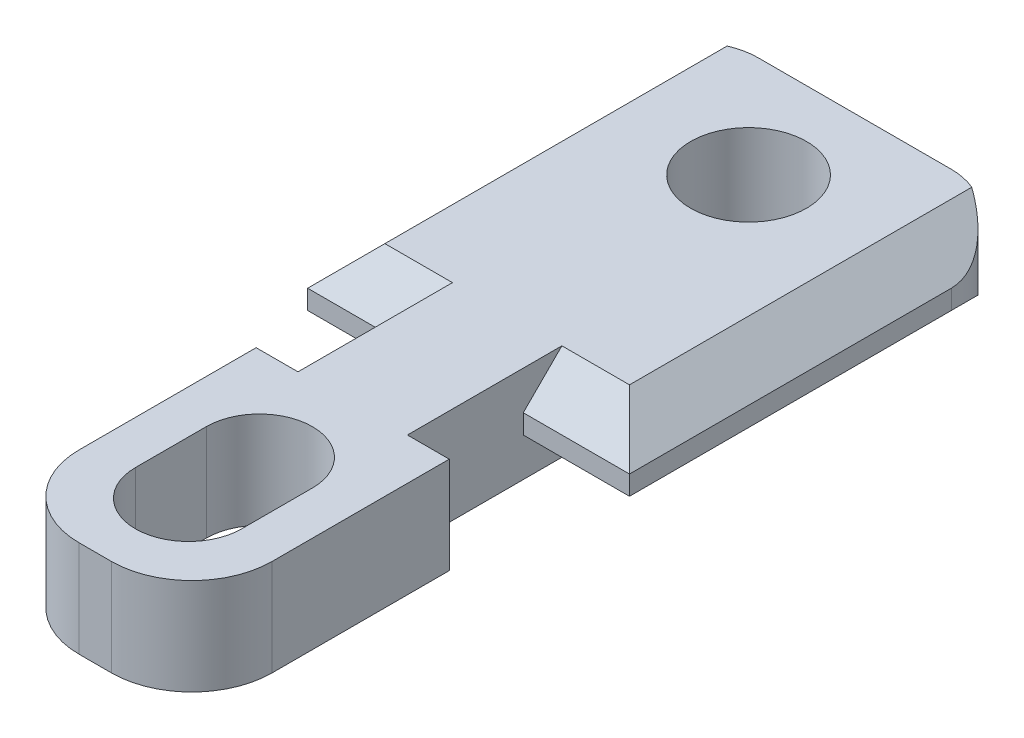
ISO-10303-21;
HEADER;
FILE_DESCRIPTION(('STEP AP214'),'2;1');
FILE_NAME('part.step','',(''),(''),'','','');
FILE_SCHEMA(('AUTOMOTIVE_DESIGN { 1 0 10303 214 1 1 1 1 }'));
ENDSEC;
DATA;
#1=APPLICATION_CONTEXT('core data for automotive mechanical design processes');
#2=APPLICATION_PROTOCOL_DEFINITION('international standard','automotive_design',2000,#1);
#3=PRODUCT_CONTEXT('',#1,'mechanical');
#4=PRODUCT('Part','Part','',(#3));
#5=PRODUCT_RELATED_PRODUCT_CATEGORY('part','',(#4));
#6=PRODUCT_DEFINITION_FORMATION('','',#4);
#7=PRODUCT_DEFINITION_CONTEXT('part definition',#1,'design');
#8=PRODUCT_DEFINITION('design','',#6,#7);
#9=PRODUCT_DEFINITION_SHAPE('','',#8);
#10=(LENGTH_UNIT() NAMED_UNIT(*) SI_UNIT(.MILLI.,.METRE.));
#11=(NAMED_UNIT(*) PLANE_ANGLE_UNIT() SI_UNIT($,.RADIAN.));
#12=(NAMED_UNIT(*) SI_UNIT($,.STERADIAN.) SOLID_ANGLE_UNIT());
#13=UNCERTAINTY_MEASURE_WITH_UNIT(LENGTH_MEASURE(1.E-05),#10,'distance_accuracy_value','');
#14=(GEOMETRIC_REPRESENTATION_CONTEXT(3) GLOBAL_UNCERTAINTY_ASSIGNED_CONTEXT((#13)) GLOBAL_UNIT_ASSIGNED_CONTEXT((#10,
#11,#12)) REPRESENTATION_CONTEXT('',''));
#15=CARTESIAN_POINT('',(0.,0.,0.));
#16=DIRECTION('',(0.,0.,1.));
#17=DIRECTION('',(1.,0.,0.));
#18=AXIS2_PLACEMENT_3D('',#15,#16,#17);
#19=CARTESIAN_POINT('',(-3.,1.5,-4.));
#20=DIRECTION('',(0.,0.,1.));
#21=DIRECTION('',(1.,0.,0.));
#22=AXIS2_PLACEMENT_3D('',#19,#20,#21);
#23=PLANE('',#22);
#24=DIRECTION('',(0.,-1.,0.));
#25=VECTOR('',#24,1.);
#26=CARTESIAN_POINT('',(1.7,1.5,-4.));
#27=LINE('',#26,#25);
#28=CARTESIAN_POINT('',(1.7,1.5,-4.));
#29=VERTEX_POINT('',#28);
#30=CARTESIAN_POINT('',(1.7,-1.5,-4.));
#31=VERTEX_POINT('',#30);
#32=EDGE_CURVE('E291',#29,#31,#27,.T.);
#33=ORIENTED_EDGE('',*,*,#32,.F.);
#34=DIRECTION('',(-1.,0.,0.));
#35=VECTOR('',#34,1.);
#36=CARTESIAN_POINT('',(-3.,1.5,-4.));
#37=LINE('',#36,#35);
#38=CARTESIAN_POINT('',(3.,1.5,-4.));
#39=VERTEX_POINT('',#38);
#40=EDGE_CURVE('E307',#39,#29,#37,.T.);
#41=ORIENTED_EDGE('',*,*,#40,.F.);
#42=DIRECTION('',(0.,-1.,0.));
#43=VECTOR('',#42,1.);
#44=CARTESIAN_POINT('',(3.,1.5,-4.));
#45=LINE('',#44,#43);
#46=CARTESIAN_POINT('',(3.,-1.5,-4.));
#47=VERTEX_POINT('',#46);
#48=EDGE_CURVE('E323',#39,#47,#45,.T.);
#49=ORIENTED_EDGE('',*,*,#48,.T.);
#50=DIRECTION('',(-1.,0.,0.));
#51=VECTOR('',#50,1.);
#52=CARTESIAN_POINT('',(-3.,-1.5,-4.));
#53=LINE('',#52,#51);
#54=EDGE_CURVE('E301',#47,#31,#53,.T.);
#55=ORIENTED_EDGE('',*,*,#54,.T.);
#56=EDGE_LOOP('',(#33,#41,#49,#55));
#57=FACE_BOUND('',#56,.T.);
#58=ADVANCED_FACE('F39',(#57),#23,.F.);
#59=CARTESIAN_POINT('',(-3.,1.5,-4.));
#60=DIRECTION('',(1.,0.,0.));
#61=DIRECTION('',(0.,0.,-1.));
#62=AXIS2_PLACEMENT_3D('',#59,#60,#61);
#63=PLANE('',#62);
#64=DIRECTION('',(0.,0.,1.));
#65=VECTOR('',#64,1.);
#66=CARTESIAN_POINT('',(-3.,-1.5,-4.));
#67=LINE('',#66,#65);
#68=CARTESIAN_POINT('',(-3.,-1.5,-4.));
#69=VERTEX_POINT('',#68);
#70=CARTESIAN_POINT('',(-3.,-1.5,1.5));
#71=VERTEX_POINT('',#70);
#72=EDGE_CURVE('E296',#69,#71,#67,.T.);
#73=ORIENTED_EDGE('',*,*,#72,.T.);
#74=DIRECTION('',(0.,-1.,0.));
#75=VECTOR('',#74,1.);
#76=CARTESIAN_POINT('',(-3.,1.5,1.5));
#77=LINE('',#76,#75);
#78=CARTESIAN_POINT('',(-3.,1.5,1.5));
#79=VERTEX_POINT('',#78);
#80=EDGE_CURVE('E352',#71,#79,#77,.F.);
#81=ORIENTED_EDGE('',*,*,#80,.T.);
#82=DIRECTION('',(0.,0.,1.));
#83=VECTOR('',#82,1.);
#84=CARTESIAN_POINT('',(-3.,1.5,-4.));
#85=LINE('',#84,#83);
#86=CARTESIAN_POINT('',(-3.,1.5,-4.));
#87=VERTEX_POINT('',#86);
#88=EDGE_CURVE('E297',#87,#79,#85,.T.);
#89=ORIENTED_EDGE('',*,*,#88,.F.);
#90=DIRECTION('',(0.,-1.,0.));
#91=VECTOR('',#90,1.);
#92=CARTESIAN_POINT('',(-3.,1.5,-4.));
#93=LINE('',#92,#91);
#94=EDGE_CURVE('E310',#87,#69,#93,.T.);
#95=ORIENTED_EDGE('',*,*,#94,.T.);
#96=EDGE_LOOP('',(#73,#81,#89,#95));
#97=FACE_BOUND('',#96,.T.);
#98=ADVANCED_FACE('F495',(#97),#63,.F.);
#99=CARTESIAN_POINT('',(-3.,1.5,4.));
#100=DIRECTION('',(0.,0.,-1.));
#101=DIRECTION('',(-1.,0.,0.));
#102=AXIS2_PLACEMENT_3D('',#99,#100,#101);
#103=PLANE('',#102);
#104=DIRECTION('',(1.,0.,0.));
#105=VECTOR('',#104,1.);
#106=CARTESIAN_POINT('',(-3.,-1.5,4.));
#107=LINE('',#106,#105);
#108=CARTESIAN_POINT('',(-0.5,-1.5,4.));
#109=VERTEX_POINT('',#108);
#110=CARTESIAN_POINT('',(0.5,-1.5,4.));
#111=VERTEX_POINT('',#110);
#112=EDGE_CURVE('E313',#109,#111,#107,.T.);
#113=ORIENTED_EDGE('',*,*,#112,.T.);
#114=DIRECTION('',(0.,-1.,0.));
#115=VECTOR('',#114,1.);
#116=CARTESIAN_POINT('',(0.5,1.5,4.));
#117=LINE('',#116,#115);
#118=CARTESIAN_POINT('',(0.5,1.5,4.));
#119=VERTEX_POINT('',#118);
#120=EDGE_CURVE('E341',#111,#119,#117,.F.);
#121=ORIENTED_EDGE('',*,*,#120,.T.);
#122=DIRECTION('',(1.,0.,0.));
#123=VECTOR('',#122,1.);
#124=CARTESIAN_POINT('',(-3.,1.5,4.));
#125=LINE('',#124,#123);
#126=CARTESIAN_POINT('',(-0.5,1.5,4.));
#127=VERTEX_POINT('',#126);
#128=EDGE_CURVE('E300',#127,#119,#125,.T.);
#129=ORIENTED_EDGE('',*,*,#128,.F.);
#130=DIRECTION('',(0.,-1.,0.));
#131=VECTOR('',#130,1.);
#132=CARTESIAN_POINT('',(-0.5,1.5,4.));
#133=LINE('',#132,#131);
#134=EDGE_CURVE('E338',#127,#109,#133,.T.);
#135=ORIENTED_EDGE('',*,*,#134,.T.);
#136=EDGE_LOOP('',(#113,#121,#129,#135));
#137=FACE_BOUND('',#136,.T.);
#138=ADVANCED_FACE('F504',(#137),#103,.F.);
#139=CARTESIAN_POINT('',(3.,1.5,-4.));
#140=DIRECTION('',(-1.,0.,0.));
#141=DIRECTION('',(0.,0.,1.));
#142=AXIS2_PLACEMENT_3D('',#139,#140,#141);
#143=PLANE('',#142);
#144=DIRECTION('',(0.,0.,-1.));
#145=VECTOR('',#144,1.);
#146=CARTESIAN_POINT('',(3.,1.5,-4.));
#147=LINE('',#146,#145);
#148=CARTESIAN_POINT('',(3.,1.5,1.5));
#149=VERTEX_POINT('',#148);
#150=EDGE_CURVE('E304',#149,#39,#147,.T.);
#151=ORIENTED_EDGE('',*,*,#150,.F.);
#152=DIRECTION('',(0.,-1.,0.));
#153=VECTOR('',#152,1.);
#154=CARTESIAN_POINT('',(3.,1.5,1.5));
#155=LINE('',#154,#153);
#156=CARTESIAN_POINT('',(3.,-1.5,1.5));
#157=VERTEX_POINT('',#156);
#158=EDGE_CURVE('E326',#149,#157,#155,.T.);
#159=ORIENTED_EDGE('',*,*,#158,.T.);
#160=DIRECTION('',(0.,0.,-1.));
#161=VECTOR('',#160,1.);
#162=CARTESIAN_POINT('',(3.,-1.5,-4.));
#163=LINE('',#162,#161);
#164=EDGE_CURVE('E316',#157,#47,#163,.T.);
#165=ORIENTED_EDGE('',*,*,#164,.T.);
#166=ORIENTED_EDGE('',*,*,#48,.F.);
#167=EDGE_LOOP('',(#151,#159,#165,#166));
#168=FACE_BOUND('',#167,.T.);
#169=ADVANCED_FACE('F512',(#168),#143,.F.);
#170=CARTESIAN_POINT('',(-1.7,1.5,-4.));
#171=VERTEX_POINT('',#170);
#172=EDGE_CURVE('E306',#171,#87,#37,.T.);
#173=ORIENTED_EDGE('',*,*,#172,.F.);
#174=DIRECTION('',(0.,-1.,0.));
#175=VECTOR('',#174,1.);
#176=CARTESIAN_POINT('',(-1.7,1.5,-4.));
#177=LINE('',#176,#175);
#178=CARTESIAN_POINT('',(-1.7,-1.5,-4.));
#179=VERTEX_POINT('',#178);
#180=EDGE_CURVE('E293',#171,#179,#177,.T.);
#181=ORIENTED_EDGE('',*,*,#180,.T.);
#182=EDGE_CURVE('E318',#179,#69,#53,.T.);
#183=ORIENTED_EDGE('',*,*,#182,.T.);
#184=ORIENTED_EDGE('',*,*,#94,.F.);
#185=EDGE_LOOP('',(#173,#181,#183,#184));
#186=FACE_BOUND('',#185,.T.);
#187=ADVANCED_FACE('F489',(#186),#23,.F.);
#188=CARTESIAN_POINT('',(0.,1.5,0.));
#189=DIRECTION('',(0.,1.,0.));
#190=DIRECTION('',(0.,0.,1.));
#191=AXIS2_PLACEMENT_3D('',#188,#189,#190);
#192=PLANE('',#191);
#193=CARTESIAN_POINT('',(0.,1.5,1.1));
#194=DIRECTION('',(0.,1.,0.));
#195=DIRECTION('',(0.,0.,1.));
#196=AXIS2_PLACEMENT_3D('',#193,#194,#195);
#197=CIRCLE('',#196,1.65);
#198=CARTESIAN_POINT('',(-1.65,1.5,1.1));
#199=VERTEX_POINT('',#198);
#200=CARTESIAN_POINT('',(1.65,1.5,1.1));
#201=VERTEX_POINT('',#200);
#202=EDGE_CURVE('E236',#199,#201,#197,.T.);
#203=ORIENTED_EDGE('',*,*,#202,.F.);
#204=DIRECTION('',(0.,0.,1.));
#205=VECTOR('',#204,1.);
#206=CARTESIAN_POINT('',(-1.65,1.5,1.1));
#207=LINE('',#206,#205);
#208=CARTESIAN_POINT('',(-1.65,1.5,-1.1));
#209=VERTEX_POINT('',#208);
#210=EDGE_CURVE('E241',#209,#199,#207,.T.);
#211=ORIENTED_EDGE('',*,*,#210,.F.);
#212=CARTESIAN_POINT('',(0.,1.5,-1.1));
#213=DIRECTION('',(0.,1.,0.));
#214=DIRECTION('',(0.,0.,1.));
#215=AXIS2_PLACEMENT_3D('',#212,#213,#214);
#216=CIRCLE('',#215,1.65);
#217=CARTESIAN_POINT('',(1.65,1.5,-1.1));
#218=VERTEX_POINT('',#217);
#219=EDGE_CURVE('E220',#218,#209,#216,.T.);
#220=ORIENTED_EDGE('',*,*,#219,.F.);
#221=DIRECTION('',(0.,0.,-1.));
#222=VECTOR('',#221,1.);
#223=CARTESIAN_POINT('',(1.65,1.5,1.1));
#224=LINE('',#223,#222);
#225=EDGE_CURVE('E232',#201,#218,#224,.T.);
#226=ORIENTED_EDGE('',*,*,#225,.F.);
#227=EDGE_LOOP('',(#203,#211,#220,#226));
#228=FACE_BOUND('',#227,.T.);
#229=CARTESIAN_POINT('',(0.,1.5,-16.3));
#230=DIRECTION('',(0.,1.,0.));
#231=DIRECTION('',(0.,0.,1.));
#232=AXIS2_PLACEMENT_3D('',#229,#230,#231);
#233=CIRCLE('',#232,1.8);
#234=CARTESIAN_POINT('',(0.,1.5,-14.5));
#235=VERTEX_POINT('',#234);
#236=EDGE_CURVE('E260',#235,#235,#233,.T.);
#237=ORIENTED_EDGE('',*,*,#236,.F.);
#238=EDGE_LOOP('',(#237));
#239=FACE_BOUND('',#238,.T.);
#240=DIRECTION('',(1.,0.,0.));
#241=VECTOR('',#240,1.);
#242=CARTESIAN_POINT('',(-1.7,1.5,-8.79999999999999));
#243=LINE('',#242,#241);
#244=CARTESIAN_POINT('',(-3.80000000000001,1.5,-8.79999999999999));
#245=VERTEX_POINT('',#244);
#246=CARTESIAN_POINT('',(-1.7,1.5,-8.79999999999999));
#247=VERTEX_POINT('',#246);
#248=EDGE_CURVE('E393',#245,#247,#243,.T.);
#249=ORIENTED_EDGE('',*,*,#248,.T.);
#250=DIRECTION('',(0.,0.,1.));
#251=VECTOR('',#250,1.);
#252=CARTESIAN_POINT('',(-1.7,1.5,-4.));
#253=LINE('',#252,#251);
#254=EDGE_CURVE('E278',#247,#171,#253,.T.);
#255=ORIENTED_EDGE('',*,*,#254,.T.);
#256=ORIENTED_EDGE('',*,*,#172,.T.);
#257=ORIENTED_EDGE('',*,*,#88,.T.);
#258=CARTESIAN_POINT('',(-0.5,1.5,1.5));
#259=DIRECTION('',(0.,1.,0.));
#260=DIRECTION('',(0.,0.,1.));
#261=AXIS2_PLACEMENT_3D('',#258,#259,#260);
#262=CIRCLE('',#261,2.5);
#263=EDGE_CURVE('E348',#79,#127,#262,.T.);
#264=ORIENTED_EDGE('',*,*,#263,.T.);
#265=ORIENTED_EDGE('',*,*,#128,.T.);
#266=CARTESIAN_POINT('',(0.5,1.5,1.5));
#267=DIRECTION('',(0.,1.,0.));
#268=DIRECTION('',(0.,0.,1.));
#269=AXIS2_PLACEMENT_3D('',#266,#267,#268);
#270=CIRCLE('',#269,2.5);
#271=EDGE_CURVE('E350',#119,#149,#270,.T.);
#272=ORIENTED_EDGE('',*,*,#271,.T.);
#273=ORIENTED_EDGE('',*,*,#150,.T.);
#274=ORIENTED_EDGE('',*,*,#40,.T.);
#275=DIRECTION('',(0.,0.,-1.));
#276=VECTOR('',#275,1.);
#277=CARTESIAN_POINT('',(1.7,1.5,-4.));
#278=LINE('',#277,#276);
#279=CARTESIAN_POINT('',(1.7,1.5,-8.8));
#280=VERTEX_POINT('',#279);
#281=EDGE_CURVE('E280',#29,#280,#278,.T.);
#282=ORIENTED_EDGE('',*,*,#281,.T.);
#283=DIRECTION('',(1.,0.,0.));
#284=VECTOR('',#283,1.);
#285=CARTESIAN_POINT('',(5.,1.5,-8.8));
#286=LINE('',#285,#284);
#287=CARTESIAN_POINT('',(3.8,1.5,-8.8));
#288=VERTEX_POINT('',#287);
#289=EDGE_CURVE('E388',#280,#288,#286,.T.);
#290=ORIENTED_EDGE('',*,*,#289,.T.);
#291=DIRECTION('',(0.,0.,-1.));
#292=VECTOR('',#291,1.);
#293=CARTESIAN_POINT('',(3.8,1.5,-17.6));
#294=LINE('',#293,#292);
#295=CARTESIAN_POINT('',(3.8,1.5,-19.4330302779823));
#296=VERTEX_POINT('',#295);
#297=EDGE_CURVE('E386',#288,#296,#294,.T.);
#298=ORIENTED_EDGE('',*,*,#297,.T.);
#299=CARTESIAN_POINT('',(3.,1.5,-17.6));
#300=DIRECTION('',(0.,1.,0.));
#301=DIRECTION('',(0.,0.,1.));
#302=AXIS2_PLACEMENT_3D('',#299,#300,#301);
#303=CIRCLE('',#302,2.);
#304=CARTESIAN_POINT('',(3.,1.5,-19.6));
#305=VERTEX_POINT('',#304);
#306=EDGE_CURVE('E346',#296,#305,#303,.T.);
#307=ORIENTED_EDGE('',*,*,#306,.T.);
#308=DIRECTION('',(-1.,0.,0.));
#309=VECTOR('',#308,1.);
#310=CARTESIAN_POINT('',(-5.,1.5,-19.6));
#311=LINE('',#310,#309);
#312=CARTESIAN_POINT('',(-3.,1.5,-19.6));
#313=VERTEX_POINT('',#312);
#314=EDGE_CURVE('E267',#305,#313,#311,.T.);
#315=ORIENTED_EDGE('',*,*,#314,.T.);
#316=CARTESIAN_POINT('',(-3.,1.5,-17.6));
#317=DIRECTION('',(0.,1.,0.));
#318=DIRECTION('',(0.,0.,1.));
#319=AXIS2_PLACEMENT_3D('',#316,#317,#318);
#320=CIRCLE('',#319,2.);
#321=CARTESIAN_POINT('',(-3.80000000000001,1.5,-19.4330302779823));
#322=VERTEX_POINT('',#321);
#323=EDGE_CURVE('E343',#313,#322,#320,.T.);
#324=ORIENTED_EDGE('',*,*,#323,.T.);
#325=DIRECTION('',(0.,0.,1.));
#326=VECTOR('',#325,1.);
#327=CARTESIAN_POINT('',(-3.80000000000001,1.5,-7.6));
#328=LINE('',#327,#326);
#329=EDGE_CURVE('E391',#322,#245,#328,.T.);
#330=ORIENTED_EDGE('',*,*,#329,.T.);
#331=EDGE_LOOP('',(#249,#255,#256,#257,#264,#265,#272,#273,#274,#282,#290,#298,#307,#315,#324,#330));
#332=FACE_BOUND('',#331,.T.);
#333=ADVANCED_FACE('F238',(#228,#239,#332),#192,.T.);
#334=CARTESIAN_POINT('',(0.,-1.5,0.));
#335=DIRECTION('',(0.,1.,0.));
#336=DIRECTION('',(0.,0.,1.));
#337=AXIS2_PLACEMENT_3D('',#334,#335,#336);
#338=PLANE('',#337);
#339=DIRECTION('',(0.,0.,1.));
#340=VECTOR('',#339,1.);
#341=CARTESIAN_POINT('',(-1.65,-1.5,1.1));
#342=LINE('',#341,#340);
#343=CARTESIAN_POINT('',(-1.65,-1.5,-1.1));
#344=VERTEX_POINT('',#343);
#345=CARTESIAN_POINT('',(-1.65,-1.5,1.1));
#346=VERTEX_POINT('',#345);
#347=EDGE_CURVE('E252',#344,#346,#342,.T.);
#348=ORIENTED_EDGE('',*,*,#347,.T.);
#349=CARTESIAN_POINT('',(0.,-1.5,1.1));
#350=DIRECTION('',(0.,1.,0.));
#351=DIRECTION('',(0.,0.,1.));
#352=AXIS2_PLACEMENT_3D('',#349,#350,#351);
#353=CIRCLE('',#352,1.65);
#354=CARTESIAN_POINT('',(1.65,-1.5,1.1));
#355=VERTEX_POINT('',#354);
#356=EDGE_CURVE('E243',#346,#355,#353,.T.);
#357=ORIENTED_EDGE('',*,*,#356,.T.);
#358=DIRECTION('',(0.,0.,-1.));
#359=VECTOR('',#358,1.);
#360=CARTESIAN_POINT('',(1.65,-1.5,1.1));
#361=LINE('',#360,#359);
#362=CARTESIAN_POINT('',(1.65,-1.5,-1.1));
#363=VERTEX_POINT('',#362);
#364=EDGE_CURVE('E249',#355,#363,#361,.T.);
#365=ORIENTED_EDGE('',*,*,#364,.T.);
#366=CARTESIAN_POINT('',(0.,-1.5,-1.1));
#367=DIRECTION('',(0.,1.,0.));
#368=DIRECTION('',(0.,0.,1.));
#369=AXIS2_PLACEMENT_3D('',#366,#367,#368);
#370=CIRCLE('',#369,1.65);
#371=EDGE_CURVE('E223',#363,#344,#370,.T.);
#372=ORIENTED_EDGE('',*,*,#371,.T.);
#373=EDGE_LOOP('',(#348,#357,#365,#372));
#374=FACE_BOUND('',#373,.T.);
#375=CARTESIAN_POINT('',(0.,-1.5,-16.3));
#376=DIRECTION('',(0.,1.,0.));
#377=DIRECTION('',(0.,0.,1.));
#378=AXIS2_PLACEMENT_3D('',#375,#376,#377);
#379=CIRCLE('',#378,1.8);
#380=CARTESIAN_POINT('',(0.,-1.5,-14.5));
#381=VERTEX_POINT('',#380);
#382=EDGE_CURVE('E263',#381,#381,#379,.T.);
#383=ORIENTED_EDGE('',*,*,#382,.T.);
#384=EDGE_LOOP('',(#383));
#385=FACE_BOUND('',#384,.T.);
#386=DIRECTION('',(0.,0.,1.));
#387=VECTOR('',#386,1.);
#388=CARTESIAN_POINT('',(-1.7,-1.5,-4.));
#389=LINE('',#388,#387);
#390=CARTESIAN_POINT('',(-1.7,-1.5,-8.80000000000001));
#391=VERTEX_POINT('',#390);
#392=EDGE_CURVE('E277',#391,#179,#389,.T.);
#393=ORIENTED_EDGE('',*,*,#392,.F.);
#394=DIRECTION('',(-1.,0.,0.));
#395=VECTOR('',#394,1.);
#396=CARTESIAN_POINT('',(0.,-1.5,-8.80000000000001));
#397=LINE('',#396,#395);
#398=CARTESIAN_POINT('',(-3.79999999999999,-1.5,-8.80000000000001));
#399=VERTEX_POINT('',#398);
#400=EDGE_CURVE('E376',#391,#399,#397,.T.);
#401=ORIENTED_EDGE('',*,*,#400,.T.);
#402=DIRECTION('',(0.,0.,-1.));
#403=VECTOR('',#402,1.);
#404=CARTESIAN_POINT('',(-3.8,-1.5,0.));
#405=LINE('',#404,#403);
#406=CARTESIAN_POINT('',(-3.79999999999999,-1.5,-19.4330302779823));
#407=VERTEX_POINT('',#406);
#408=EDGE_CURVE('E374',#399,#407,#405,.T.);
#409=ORIENTED_EDGE('',*,*,#408,.T.);
#410=CARTESIAN_POINT('',(-3.,-1.5,-17.6));
#411=DIRECTION('',(0.,1.,0.));
#412=DIRECTION('',(0.,0.,1.));
#413=AXIS2_PLACEMENT_3D('',#410,#411,#412);
#414=CIRCLE('',#413,2.);
#415=CARTESIAN_POINT('',(-3.,-1.5,-19.6));
#416=VERTEX_POINT('',#415);
#417=EDGE_CURVE('E329',#407,#416,#414,.F.);
#418=ORIENTED_EDGE('',*,*,#417,.T.);
#419=DIRECTION('',(-1.,0.,0.));
#420=VECTOR('',#419,1.);
#421=CARTESIAN_POINT('',(-5.,-1.5,-19.6));
#422=LINE('',#421,#420);
#423=CARTESIAN_POINT('',(3.,-1.5,-19.6));
#424=VERTEX_POINT('',#423);
#425=EDGE_CURVE('E257',#424,#416,#422,.T.);
#426=ORIENTED_EDGE('',*,*,#425,.F.);
#427=CARTESIAN_POINT('',(3.,-1.5,-17.6));
#428=DIRECTION('',(0.,1.,0.));
#429=DIRECTION('',(0.,0.,1.));
#430=AXIS2_PLACEMENT_3D('',#427,#428,#429);
#431=CIRCLE('',#430,2.);
#432=CARTESIAN_POINT('',(3.79999999999999,-1.5,-19.4330302779823));
#433=VERTEX_POINT('',#432);
#434=EDGE_CURVE('E331',#424,#433,#431,.F.);
#435=ORIENTED_EDGE('',*,*,#434,.T.);
#436=DIRECTION('',(0.,0.,1.));
#437=VECTOR('',#436,1.);
#438=CARTESIAN_POINT('',(3.79999999999999,-1.5,0.));
#439=LINE('',#438,#437);
#440=CARTESIAN_POINT('',(3.79999999999999,-1.5,-8.80000000000001));
#441=VERTEX_POINT('',#440);
#442=EDGE_CURVE('E369',#433,#441,#439,.T.);
#443=ORIENTED_EDGE('',*,*,#442,.T.);
#444=DIRECTION('',(-1.,0.,0.));
#445=VECTOR('',#444,1.);
#446=CARTESIAN_POINT('',(0.,-1.5,-8.80000000000001));
#447=LINE('',#446,#445);
#448=CARTESIAN_POINT('',(1.7,-1.5,-8.80000000000001));
#449=VERTEX_POINT('',#448);
#450=EDGE_CURVE('E371',#441,#449,#447,.T.);
#451=ORIENTED_EDGE('',*,*,#450,.T.);
#452=DIRECTION('',(0.,0.,-1.));
#453=VECTOR('',#452,1.);
#454=CARTESIAN_POINT('',(1.7,-1.5,-4.));
#455=LINE('',#454,#453);
#456=EDGE_CURVE('E281',#31,#449,#455,.T.);
#457=ORIENTED_EDGE('',*,*,#456,.F.);
#458=ORIENTED_EDGE('',*,*,#54,.F.);
#459=ORIENTED_EDGE('',*,*,#164,.F.);
#460=CARTESIAN_POINT('',(0.5,-1.5,1.5));
#461=DIRECTION('',(0.,1.,0.));
#462=DIRECTION('',(0.,0.,1.));
#463=AXIS2_PLACEMENT_3D('',#460,#461,#462);
#464=CIRCLE('',#463,2.5);
#465=EDGE_CURVE('E336',#157,#111,#464,.F.);
#466=ORIENTED_EDGE('',*,*,#465,.T.);
#467=ORIENTED_EDGE('',*,*,#112,.F.);
#468=CARTESIAN_POINT('',(-0.5,-1.5,1.5));
#469=DIRECTION('',(0.,1.,0.));
#470=DIRECTION('',(0.,0.,1.));
#471=AXIS2_PLACEMENT_3D('',#468,#469,#470);
#472=CIRCLE('',#471,2.5);
#473=EDGE_CURVE('E334',#109,#71,#472,.F.);
#474=ORIENTED_EDGE('',*,*,#473,.T.);
#475=ORIENTED_EDGE('',*,*,#72,.F.);
#476=ORIENTED_EDGE('',*,*,#182,.F.);
#477=EDGE_LOOP('',(#393,#401,#409,#418,#426,#435,#443,#451,#457,#458,#459,#466,#467,#474,#475,#476));
#478=FACE_BOUND('',#477,.T.);
#479=ADVANCED_FACE('F450',(#374,#385,#478),#338,.F.);
#480=CARTESIAN_POINT('',(-1.7,1.5,-4.));
#481=DIRECTION('',(1.,0.,0.));
#482=DIRECTION('',(0.,0.,-1.));
#483=AXIS2_PLACEMENT_3D('',#480,#481,#482);
#484=PLANE('',#483);
#485=ORIENTED_EDGE('',*,*,#392,.T.);
#486=ORIENTED_EDGE('',*,*,#180,.F.);
#487=ORIENTED_EDGE('',*,*,#254,.F.);
#488=DIRECTION('',(0.,-0.707106781186549,0.707106781186546));
#489=VECTOR('',#488,1.);
#490=CARTESIAN_POINT('',(-1.7,-0.899999999999996,-6.4));
#491=LINE('',#490,#489);
#492=CARTESIAN_POINT('',(-1.7,0.300000000000004,-7.6));
#493=VERTEX_POINT('',#492);
#494=EDGE_CURVE('E410',#247,#493,#491,.T.);
#495=ORIENTED_EDGE('',*,*,#494,.T.);
#496=DIRECTION('',(0.,-1.,0.));
#497=VECTOR('',#496,1.);
#498=CARTESIAN_POINT('',(-1.7,1.5,-7.6));
#499=LINE('',#498,#497);
#500=CARTESIAN_POINT('',(-1.7,-0.299999999999997,-7.6));
#501=VERTEX_POINT('',#500);
#502=EDGE_CURVE('E283',#493,#501,#499,.T.);
#503=ORIENTED_EDGE('',*,*,#502,.T.);
#504=DIRECTION('',(0.,0.707106781186547,0.707106781186548));
#505=VECTOR('',#504,1.);
#506=CARTESIAN_POINT('',(-1.7,2.4,-4.9));
#507=LINE('',#506,#505);
#508=EDGE_CURVE('E407',#501,#391,#507,.F.);
#509=ORIENTED_EDGE('',*,*,#508,.T.);
#510=EDGE_LOOP('',(#485,#486,#487,#495,#503,#509));
#511=FACE_BOUND('',#510,.T.);
#512=ADVANCED_FACE('F477',(#511),#484,.F.);
#513=CARTESIAN_POINT('',(1.7,1.5,-4.));
#514=DIRECTION('',(-1.,0.,0.));
#515=DIRECTION('',(0.,0.,1.));
#516=AXIS2_PLACEMENT_3D('',#513,#514,#515);
#517=PLANE('',#516);
#518=ORIENTED_EDGE('',*,*,#456,.T.);
#519=DIRECTION('',(0.,-0.707106781186547,-0.707106781186548));
#520=VECTOR('',#519,1.);
#521=CARTESIAN_POINT('',(1.7,2.4,-4.9));
#522=LINE('',#521,#520);
#523=CARTESIAN_POINT('',(1.7,-0.299999999999993,-7.6));
#524=VERTEX_POINT('',#523);
#525=EDGE_CURVE('E12',#449,#524,#522,.F.);
#526=ORIENTED_EDGE('',*,*,#525,.T.);
#527=DIRECTION('',(0.,-1.,0.));
#528=VECTOR('',#527,1.);
#529=CARTESIAN_POINT('',(1.7,1.5,-7.6));
#530=LINE('',#529,#528);
#531=CARTESIAN_POINT('',(1.7,0.3,-7.6));
#532=VERTEX_POINT('',#531);
#533=EDGE_CURVE('E288',#532,#524,#530,.T.);
#534=ORIENTED_EDGE('',*,*,#533,.F.);
#535=DIRECTION('',(0.,0.707106781186549,-0.707106781186546));
#536=VECTOR('',#535,1.);
#537=CARTESIAN_POINT('',(1.7,-0.899999999999997,-6.40000000000001));
#538=LINE('',#537,#536);
#539=EDGE_CURVE('E49',#532,#280,#538,.T.);
#540=ORIENTED_EDGE('',*,*,#539,.T.);
#541=ORIENTED_EDGE('',*,*,#281,.F.);
#542=ORIENTED_EDGE('',*,*,#32,.T.);
#543=EDGE_LOOP('',(#518,#526,#534,#540,#541,#542));
#544=FACE_BOUND('',#543,.T.);
#545=ADVANCED_FACE('F445',(#544),#517,.F.);
#546=CARTESIAN_POINT('',(-5.,1.5,-7.6));
#547=DIRECTION('',(0.,0.,-1.));
#548=DIRECTION('',(-1.,0.,0.));
#549=AXIS2_PLACEMENT_3D('',#546,#547,#548);
#550=PLANE('',#549);
#551=DIRECTION('',(0.,-1.,0.));
#552=VECTOR('',#551,1.);
#553=CARTESIAN_POINT('',(5.,1.5,-7.6));
#554=LINE('',#553,#552);
#555=CARTESIAN_POINT('',(5.,0.3,-7.6));
#556=VERTEX_POINT('',#555);
#557=CARTESIAN_POINT('',(5.,-0.299999999999993,-7.6));
#558=VERTEX_POINT('',#557);
#559=EDGE_CURVE('E270',#556,#558,#554,.T.);
#560=ORIENTED_EDGE('',*,*,#559,.F.);
#561=DIRECTION('',(-1.,0.,0.));
#562=VECTOR('',#561,1.);
#563=CARTESIAN_POINT('',(1.7,0.3,-7.6));
#564=LINE('',#563,#562);
#565=EDGE_CURVE('E399',#556,#532,#564,.T.);
#566=ORIENTED_EDGE('',*,*,#565,.T.);
#567=ORIENTED_EDGE('',*,*,#533,.T.);
#568=DIRECTION('',(1.,0.,0.));
#569=VECTOR('',#568,1.);
#570=CARTESIAN_POINT('',(-5.,-0.299999999999993,-7.6));
#571=LINE('',#570,#569);
#572=EDGE_CURVE('E396',#524,#558,#571,.T.);
#573=ORIENTED_EDGE('',*,*,#572,.T.);
#574=EDGE_LOOP('',(#560,#566,#567,#573));
#575=FACE_BOUND('',#574,.T.);
#576=ADVANCED_FACE('F435',(#575),#550,.F.);
#577=CARTESIAN_POINT('',(-5.,1.5,-19.6));
#578=DIRECTION('',(1.,0.,0.));
#579=DIRECTION('',(0.,0.,-1.));
#580=AXIS2_PLACEMENT_3D('',#577,#578,#579);
#581=PLANE('',#580);
#582=DIRECTION('',(0.,-1.,0.));
#583=VECTOR('',#582,1.);
#584=CARTESIAN_POINT('',(-5.,1.5,-17.6));
#585=LINE('',#584,#583);
#586=CARTESIAN_POINT('',(-5.,0.300000000000004,-17.6));
#587=VERTEX_POINT('',#586);
#588=CARTESIAN_POINT('',(-5.,-0.299999999999997,-17.6));
#589=VERTEX_POINT('',#588);
#590=EDGE_CURVE('E361',#587,#589,#585,.T.);
#591=ORIENTED_EDGE('',*,*,#590,.T.);
#592=DIRECTION('',(0.,0.,1.));
#593=VECTOR('',#592,1.);
#594=CARTESIAN_POINT('',(-5.,-0.299999999999997,-19.6));
#595=LINE('',#594,#593);
#596=CARTESIAN_POINT('',(-5.,-0.299999999999997,-7.6));
#597=VERTEX_POINT('',#596);
#598=EDGE_CURVE('E380',#589,#597,#595,.T.);
#599=ORIENTED_EDGE('',*,*,#598,.T.);
#600=DIRECTION('',(0.,-1.,0.));
#601=VECTOR('',#600,1.);
#602=CARTESIAN_POINT('',(-5.,1.5,-7.6));
#603=LINE('',#602,#601);
#604=CARTESIAN_POINT('',(-5.,0.300000000000004,-7.6));
#605=VERTEX_POINT('',#604);
#606=EDGE_CURVE('E274',#605,#597,#603,.T.);
#607=ORIENTED_EDGE('',*,*,#606,.F.);
#608=DIRECTION('',(0.,0.,-1.));
#609=VECTOR('',#608,1.);
#610=CARTESIAN_POINT('',(-5.,0.300000000000004,-17.6));
#611=LINE('',#610,#609);
#612=EDGE_CURVE('E378',#605,#587,#611,.T.);
#613=ORIENTED_EDGE('',*,*,#612,.T.);
#614=EDGE_LOOP('',(#591,#599,#607,#613));
#615=FACE_BOUND('',#614,.T.);
#616=ADVANCED_FACE('F678',(#615),#581,.F.);
#617=ORIENTED_EDGE('',*,*,#606,.T.);
#618=DIRECTION('',(1.,0.,0.));
#619=VECTOR('',#618,1.);
#620=CARTESIAN_POINT('',(-5.,-0.299999999999997,-7.6));
#621=LINE('',#620,#619);
#622=EDGE_CURVE('E366',#597,#501,#621,.T.);
#623=ORIENTED_EDGE('',*,*,#622,.T.);
#624=ORIENTED_EDGE('',*,*,#502,.F.);
#625=DIRECTION('',(-1.,0.,0.));
#626=VECTOR('',#625,1.);
#627=CARTESIAN_POINT('',(-5.,0.300000000000004,-7.6));
#628=LINE('',#627,#626);
#629=EDGE_CURVE('E364',#493,#605,#628,.T.);
#630=ORIENTED_EDGE('',*,*,#629,.T.);
#631=EDGE_LOOP('',(#617,#623,#624,#630));
#632=FACE_BOUND('',#631,.T.);
#633=ADVANCED_FACE('F479',(#632),#550,.F.);
#634=CARTESIAN_POINT('',(5.,1.5,-19.6));
#635=DIRECTION('',(-1.,0.,0.));
#636=DIRECTION('',(0.,0.,1.));
#637=AXIS2_PLACEMENT_3D('',#634,#635,#636);
#638=PLANE('',#637);
#639=DIRECTION('',(0.,-1.,0.));
#640=VECTOR('',#639,1.);
#641=CARTESIAN_POINT('',(5.,1.5,-17.6));
#642=LINE('',#641,#640);
#643=CARTESIAN_POINT('',(5.,-0.299999999999993,-17.6));
#644=VERTEX_POINT('',#643);
#645=CARTESIAN_POINT('',(5.,0.3,-17.6));
#646=VERTEX_POINT('',#645);
#647=EDGE_CURVE('E359',#644,#646,#642,.F.);
#648=ORIENTED_EDGE('',*,*,#647,.T.);
#649=DIRECTION('',(0.,0.,1.));
#650=VECTOR('',#649,1.);
#651=CARTESIAN_POINT('',(5.,0.3,-7.6));
#652=LINE('',#651,#650);
#653=EDGE_CURVE('E405',#646,#556,#652,.T.);
#654=ORIENTED_EDGE('',*,*,#653,.T.);
#655=ORIENTED_EDGE('',*,*,#559,.T.);
#656=DIRECTION('',(0.,0.,-1.));
#657=VECTOR('',#656,1.);
#658=CARTESIAN_POINT('',(5.,-0.299999999999993,-19.6));
#659=LINE('',#658,#657);
#660=EDGE_CURVE('E64',#558,#644,#659,.T.);
#661=ORIENTED_EDGE('',*,*,#660,.T.);
#662=EDGE_LOOP('',(#648,#654,#655,#661));
#663=FACE_BOUND('',#662,.T.);
#664=ADVANCED_FACE('F437',(#663),#638,.F.);
#665=CARTESIAN_POINT('',(-5.,1.5,-19.6));
#666=DIRECTION('',(0.,0.,1.));
#667=DIRECTION('',(1.,0.,0.));
#668=AXIS2_PLACEMENT_3D('',#665,#666,#667);
#669=PLANE('',#668);
#670=ORIENTED_EDGE('',*,*,#314,.F.);
#671=DIRECTION('',(0.,-1.,0.));
#672=VECTOR('',#671,1.);
#673=CARTESIAN_POINT('',(3.,1.5,-19.6));
#674=LINE('',#673,#672);
#675=EDGE_CURVE('E356',#305,#424,#674,.T.);
#676=ORIENTED_EDGE('',*,*,#675,.T.);
#677=ORIENTED_EDGE('',*,*,#425,.T.);
#678=DIRECTION('',(0.,-1.,0.));
#679=VECTOR('',#678,1.);
#680=CARTESIAN_POINT('',(-3.,1.5,-19.6));
#681=LINE('',#680,#679);
#682=EDGE_CURVE('E354',#416,#313,#681,.F.);
#683=ORIENTED_EDGE('',*,*,#682,.T.);
#684=EDGE_LOOP('',(#670,#676,#677,#683));
#685=FACE_BOUND('',#684,.T.);
#686=ADVANCED_FACE('F456',(#685),#669,.F.);
#687=CARTESIAN_POINT('',(0.5,1.5,1.5));
#688=DIRECTION('',(0.,-1.,0.));
#689=DIRECTION('',(0.,0.,-1.));
#690=AXIS2_PLACEMENT_3D('',#687,#688,#689);
#691=CYLINDRICAL_SURFACE('',#690,2.5);
#692=ORIENTED_EDGE('',*,*,#271,.F.);
#693=ORIENTED_EDGE('',*,*,#120,.F.);
#694=ORIENTED_EDGE('',*,*,#465,.F.);
#695=ORIENTED_EDGE('',*,*,#158,.F.);
#696=EDGE_LOOP('',(#692,#693,#694,#695));
#697=FACE_BOUND('',#696,.T.);
#698=ADVANCED_FACE('F507',(#697),#691,.T.);
#699=CARTESIAN_POINT('',(-0.5,1.5,1.5));
#700=DIRECTION('',(0.,-1.,0.));
#701=DIRECTION('',(0.,0.,-1.));
#702=AXIS2_PLACEMENT_3D('',#699,#700,#701);
#703=CYLINDRICAL_SURFACE('',#702,2.5);
#704=ORIENTED_EDGE('',*,*,#263,.F.);
#705=ORIENTED_EDGE('',*,*,#80,.F.);
#706=ORIENTED_EDGE('',*,*,#473,.F.);
#707=ORIENTED_EDGE('',*,*,#134,.F.);
#708=EDGE_LOOP('',(#704,#705,#706,#707));
#709=FACE_BOUND('',#708,.T.);
#710=ADVANCED_FACE('F499',(#709),#703,.T.);
#711=CARTESIAN_POINT('',(3.,1.5,-17.6));
#712=DIRECTION('',(0.,-1.,0.));
#713=DIRECTION('',(0.,0.,-1.));
#714=AXIS2_PLACEMENT_3D('',#711,#712,#713);
#715=CYLINDRICAL_SURFACE('',#714,2.);
#716=ORIENTED_EDGE('',*,*,#306,.F.);
#717=CARTESIAN_POINT('',(3.,2.30000000000001,-17.6));
#718=DIRECTION('',(0.707106781186549,0.707106781186547,0.));
#719=DIRECTION('',(0.707106781186547,-0.707106781186549,0.));
#720=AXIS2_PLACEMENT_3D('',#717,#718,#719);
#721=ELLIPSE('',#720,2.82842712474619,2.);
#722=EDGE_CURVE('E57',#296,#646,#721,.F.);
#723=ORIENTED_EDGE('',*,*,#722,.T.);
#724=ORIENTED_EDGE('',*,*,#647,.F.);
#725=CARTESIAN_POINT('',(3.,-2.29999999999999,-17.6));
#726=DIRECTION('',(-0.707106781186547,0.707106781186549,0.));
#727=DIRECTION('',(-0.707106781186549,-0.707106781186547,0.));
#728=AXIS2_PLACEMENT_3D('',#725,#726,#727);
#729=ELLIPSE('',#728,2.82842712474619,2.);
#730=EDGE_CURVE('E401',#644,#433,#729,.T.);
#731=ORIENTED_EDGE('',*,*,#730,.T.);
#732=ORIENTED_EDGE('',*,*,#434,.F.);
#733=ORIENTED_EDGE('',*,*,#675,.F.);
#734=EDGE_LOOP('',(#716,#723,#724,#731,#732,#733));
#735=FACE_BOUND('',#734,.T.);
#736=ADVANCED_FACE('F453',(#735),#715,.T.);
#737=CARTESIAN_POINT('',(-3.,1.5,-17.6));
#738=DIRECTION('',(0.,-1.,0.));
#739=DIRECTION('',(0.,0.,-1.));
#740=AXIS2_PLACEMENT_3D('',#737,#738,#739);
#741=CYLINDRICAL_SURFACE('',#740,2.);
#742=ORIENTED_EDGE('',*,*,#417,.F.);
#743=CARTESIAN_POINT('',(-3.,-2.29999999999999,-17.6));
#744=DIRECTION('',(0.707106781186547,0.707106781186548,0.));
#745=DIRECTION('',(0.707106781186548,-0.707106781186547,0.));
#746=AXIS2_PLACEMENT_3D('',#743,#744,#745);
#747=ELLIPSE('',#746,2.82842712474619,2.);
#748=EDGE_CURVE('E384',#407,#589,#747,.T.);
#749=ORIENTED_EDGE('',*,*,#748,.T.);
#750=ORIENTED_EDGE('',*,*,#590,.F.);
#751=CARTESIAN_POINT('',(-3.,2.30000000000001,-17.6));
#752=DIRECTION('',(-0.707106781186549,0.707106781186547,0.));
#753=DIRECTION('',(-0.707106781186546,-0.707106781186549,0.));
#754=AXIS2_PLACEMENT_3D('',#751,#752,#753);
#755=ELLIPSE('',#754,2.82842712474619,2.);
#756=EDGE_CURVE('E382',#587,#322,#755,.F.);
#757=ORIENTED_EDGE('',*,*,#756,.T.);
#758=ORIENTED_EDGE('',*,*,#323,.F.);
#759=ORIENTED_EDGE('',*,*,#682,.F.);
#760=EDGE_LOOP('',(#742,#749,#750,#757,#758,#759));
#761=FACE_BOUND('',#760,.T.);
#762=ADVANCED_FACE('F462',(#761),#741,.T.);
#763=CARTESIAN_POINT('',(0.,-1.5,-16.3));
#764=DIRECTION('',(0.,1.,0.));
#765=DIRECTION('',(0.,0.,1.));
#766=AXIS2_PLACEMENT_3D('',#763,#764,#765);
#767=CYLINDRICAL_SURFACE('',#766,1.8);
#768=ORIENTED_EDGE('',*,*,#382,.F.);
#769=EDGE_LOOP('',(#768));
#770=FACE_BOUND('',#769,.T.);
#771=ORIENTED_EDGE('',*,*,#236,.T.);
#772=EDGE_LOOP('',(#771));
#773=FACE_BOUND('',#772,.T.);
#774=ADVANCED_FACE('F543',(#770,#773),#767,.F.);
#775=CARTESIAN_POINT('',(0.,-1.5,1.1));
#776=DIRECTION('',(0.,1.,0.));
#777=DIRECTION('',(0.,0.,1.));
#778=AXIS2_PLACEMENT_3D('',#775,#776,#777);
#779=CYLINDRICAL_SURFACE('',#778,1.65);
#780=DIRECTION('',(0.,1.,0.));
#781=VECTOR('',#780,1.);
#782=CARTESIAN_POINT('',(1.65,-1.5,1.1));
#783=LINE('',#782,#781);
#784=EDGE_CURVE('E228',#355,#201,#783,.T.);
#785=ORIENTED_EDGE('',*,*,#784,.F.);
#786=ORIENTED_EDGE('',*,*,#356,.F.);
#787=DIRECTION('',(0.,1.,0.));
#788=VECTOR('',#787,1.);
#789=CARTESIAN_POINT('',(-1.65,-1.5,1.1));
#790=LINE('',#789,#788);
#791=EDGE_CURVE('E255',#346,#199,#790,.T.);
#792=ORIENTED_EDGE('',*,*,#791,.T.);
#793=ORIENTED_EDGE('',*,*,#202,.T.);
#794=EDGE_LOOP('',(#785,#786,#792,#793));
#795=FACE_BOUND('',#794,.T.);
#796=ADVANCED_FACE('F629',(#795),#779,.F.);
#797=CARTESIAN_POINT('',(-1.65,-1.5,1.1));
#798=DIRECTION('',(-1.,0.,0.));
#799=DIRECTION('',(0.,0.,1.));
#800=AXIS2_PLACEMENT_3D('',#797,#798,#799);
#801=PLANE('',#800);
#802=ORIENTED_EDGE('',*,*,#791,.F.);
#803=ORIENTED_EDGE('',*,*,#347,.F.);
#804=DIRECTION('',(0.,1.,0.));
#805=VECTOR('',#804,1.);
#806=CARTESIAN_POINT('',(-1.65,-1.5,-1.1));
#807=LINE('',#806,#805);
#808=EDGE_CURVE('E227',#344,#209,#807,.T.);
#809=ORIENTED_EDGE('',*,*,#808,.T.);
#810=ORIENTED_EDGE('',*,*,#210,.T.);
#811=EDGE_LOOP('',(#802,#803,#809,#810));
#812=FACE_BOUND('',#811,.T.);
#813=ADVANCED_FACE('F622',(#812),#801,.F.);
#814=CARTESIAN_POINT('',(0.,-1.5,-1.1));
#815=DIRECTION('',(0.,1.,0.));
#816=DIRECTION('',(0.,0.,1.));
#817=AXIS2_PLACEMENT_3D('',#814,#815,#816);
#818=CYLINDRICAL_SURFACE('',#817,1.65);
#819=ORIENTED_EDGE('',*,*,#808,.F.);
#820=ORIENTED_EDGE('',*,*,#371,.F.);
#821=DIRECTION('',(0.,1.,0.));
#822=VECTOR('',#821,1.);
#823=CARTESIAN_POINT('',(1.65,-1.5,-1.1));
#824=LINE('',#823,#822);
#825=EDGE_CURVE('E216',#363,#218,#824,.T.);
#826=ORIENTED_EDGE('',*,*,#825,.T.);
#827=ORIENTED_EDGE('',*,*,#219,.T.);
#828=EDGE_LOOP('',(#819,#820,#826,#827));
#829=FACE_BOUND('',#828,.T.);
#830=ADVANCED_FACE('F218',(#829),#818,.F.);
#831=CARTESIAN_POINT('',(1.65,-1.5,1.1));
#832=DIRECTION('',(1.,0.,0.));
#833=DIRECTION('',(0.,0.,-1.));
#834=AXIS2_PLACEMENT_3D('',#831,#832,#833);
#835=PLANE('',#834);
#836=ORIENTED_EDGE('',*,*,#825,.F.);
#837=ORIENTED_EDGE('',*,*,#364,.F.);
#838=ORIENTED_EDGE('',*,*,#784,.T.);
#839=ORIENTED_EDGE('',*,*,#225,.T.);
#840=EDGE_LOOP('',(#836,#837,#838,#839));
#841=FACE_BOUND('',#840,.T.);
#842=ADVANCED_FACE('F233',(#841),#835,.F.);
#843=CARTESIAN_POINT('',(-5.,-0.299999999999997,-19.6));
#844=DIRECTION('',(0.707106781186547,0.707106781186548,0.));
#845=DIRECTION('',(0.,0.,1.));
#846=AXIS2_PLACEMENT_3D('',#843,#844,#845);
#847=PLANE('',#846);
#848=ORIENTED_EDGE('',*,*,#748,.F.);
#849=ORIENTED_EDGE('',*,*,#408,.F.);
#850=DIRECTION('',(-0.577350269189626,0.577350269189625,0.577350269189626));
#851=VECTOR('',#850,1.);
#852=CARTESIAN_POINT('',(-0.999999999999994,-4.29999999999999,-11.6));
#853=LINE('',#852,#851);
#854=EDGE_CURVE('E264',#597,#399,#853,.F.);
#855=ORIENTED_EDGE('',*,*,#854,.F.);
#856=ORIENTED_EDGE('',*,*,#598,.F.);
#857=EDGE_LOOP('',(#848,#849,#855,#856));
#858=FACE_BOUND('',#857,.T.);
#859=ADVANCED_FACE('F551',(#858),#847,.F.);
#860=CARTESIAN_POINT('',(-5.,-0.299999999999997,-7.6));
#861=DIRECTION('',(0.,0.707106781186548,-0.707106781186547));
#862=DIRECTION('',(1.,0.,0.));
#863=AXIS2_PLACEMENT_3D('',#860,#861,#862);
#864=PLANE('',#863);
#865=ORIENTED_EDGE('',*,*,#854,.T.);
#866=ORIENTED_EDGE('',*,*,#400,.F.);
#867=ORIENTED_EDGE('',*,*,#508,.F.);
#868=ORIENTED_EDGE('',*,*,#622,.F.);
#869=EDGE_LOOP('',(#865,#866,#867,#868));
#870=FACE_BOUND('',#869,.T.);
#871=ADVANCED_FACE('F484',(#870),#864,.F.);
#872=CARTESIAN_POINT('',(-3.80000000000001,1.5,0.));
#873=DIRECTION('',(-0.707106781186549,0.707106781186547,0.));
#874=DIRECTION('',(0.,0.,-1.));
#875=AXIS2_PLACEMENT_3D('',#872,#873,#874);
#876=PLANE('',#875);
#877=ORIENTED_EDGE('',*,*,#756,.F.);
#878=ORIENTED_EDGE('',*,*,#612,.F.);
#879=DIRECTION('',(0.577350269189625,0.577350269189627,-0.577350269189625));
#880=VECTOR('',#879,1.);
#881=CARTESIAN_POINT('',(-6.73333333333333,-1.43333333333333,-5.86666666666667));
#882=LINE('',#881,#880);
#883=EDGE_CURVE('E416',#245,#605,#882,.F.);
#884=ORIENTED_EDGE('',*,*,#883,.F.);
#885=ORIENTED_EDGE('',*,*,#329,.F.);
#886=EDGE_LOOP('',(#877,#878,#884,#885));
#887=FACE_BOUND('',#886,.T.);
#888=ADVANCED_FACE('F467',(#887),#876,.T.);
#889=CARTESIAN_POINT('',(0.,1.5,-8.79999999999999));
#890=DIRECTION('',(0.,0.707106781186546,0.707106781186549));
#891=DIRECTION('',(-1.,0.,0.));
#892=AXIS2_PLACEMENT_3D('',#889,#890,#891);
#893=PLANE('',#892);
#894=ORIENTED_EDGE('',*,*,#883,.T.);
#895=ORIENTED_EDGE('',*,*,#629,.F.);
#896=ORIENTED_EDGE('',*,*,#494,.F.);
#897=ORIENTED_EDGE('',*,*,#248,.F.);
#898=EDGE_LOOP('',(#894,#895,#896,#897));
#899=FACE_BOUND('',#898,.T.);
#900=ADVANCED_FACE('F473',(#899),#893,.T.);
#901=CARTESIAN_POINT('',(3.8,1.5,0.));
#902=DIRECTION('',(0.707106781186549,0.707106781186547,0.));
#903=DIRECTION('',(0.,0.,1.));
#904=AXIS2_PLACEMENT_3D('',#901,#902,#903);
#905=PLANE('',#904);
#906=ORIENTED_EDGE('',*,*,#722,.F.);
#907=ORIENTED_EDGE('',*,*,#297,.F.);
#908=DIRECTION('',(0.577350269189625,-0.577350269189627,0.577350269189625));
#909=VECTOR('',#908,1.);
#910=CARTESIAN_POINT('',(6.73333333333333,-1.43333333333333,-5.86666666666667));
#911=LINE('',#910,#909);
#912=EDGE_CURVE('E418',#556,#288,#911,.F.);
#913=ORIENTED_EDGE('',*,*,#912,.F.);
#914=ORIENTED_EDGE('',*,*,#653,.F.);
#915=EDGE_LOOP('',(#906,#907,#913,#914));
#916=FACE_BOUND('',#915,.T.);
#917=ADVANCED_FACE('F440',(#916),#905,.T.);
#918=CARTESIAN_POINT('',(0.,1.5,-8.8));
#919=DIRECTION('',(0.,0.707106781186546,0.707106781186549));
#920=DIRECTION('',(-1.,0.,0.));
#921=AXIS2_PLACEMENT_3D('',#918,#919,#920);
#922=PLANE('',#921);
#923=ORIENTED_EDGE('',*,*,#539,.F.);
#924=ORIENTED_EDGE('',*,*,#565,.F.);
#925=ORIENTED_EDGE('',*,*,#912,.T.);
#926=ORIENTED_EDGE('',*,*,#289,.F.);
#927=EDGE_LOOP('',(#923,#924,#925,#926));
#928=FACE_BOUND('',#927,.T.);
#929=ADVANCED_FACE('F443',(#928),#922,.T.);
#930=CARTESIAN_POINT('',(5.,-0.299999999999993,-19.6));
#931=DIRECTION('',(-0.707106781186547,0.707106781186549,0.));
#932=DIRECTION('',(0.,0.,-1.));
#933=AXIS2_PLACEMENT_3D('',#930,#931,#932);
#934=PLANE('',#933);
#935=ORIENTED_EDGE('',*,*,#730,.F.);
#936=ORIENTED_EDGE('',*,*,#660,.F.);
#937=DIRECTION('',(-0.577350269189626,-0.577350269189625,-0.577350269189626));
#938=VECTOR('',#937,1.);
#939=CARTESIAN_POINT('',(0.999999999999996,-4.29999999999999,-11.6));
#940=LINE('',#939,#938);
#941=EDGE_CURVE('E44',#441,#558,#940,.F.);
#942=ORIENTED_EDGE('',*,*,#941,.F.);
#943=ORIENTED_EDGE('',*,*,#442,.F.);
#944=EDGE_LOOP('',(#935,#936,#942,#943));
#945=FACE_BOUND('',#944,.T.);
#946=ADVANCED_FACE('F42',(#945),#934,.F.);
#947=CARTESIAN_POINT('',(-5.,-0.299999999999993,-7.6));
#948=DIRECTION('',(0.,0.707106781186548,-0.707106781186547));
#949=DIRECTION('',(1.,0.,0.));
#950=AXIS2_PLACEMENT_3D('',#947,#948,#949);
#951=PLANE('',#950);
#952=ORIENTED_EDGE('',*,*,#525,.F.);
#953=ORIENTED_EDGE('',*,*,#450,.F.);
#954=ORIENTED_EDGE('',*,*,#941,.T.);
#955=ORIENTED_EDGE('',*,*,#572,.F.);
#956=EDGE_LOOP('',(#952,#953,#954,#955));
#957=FACE_BOUND('',#956,.T.);
#958=ADVANCED_FACE('F429',(#957),#951,.F.);
#959=CLOSED_SHELL('',(#58,#98,#138,#169,#187,#333,#479,#512,#545,#576,#616,#633,#664,#686,#698,
#710,#736,#762,#774,#796,#813,#830,#842,#859,#871,#888,#900,#917,#929,#946,#958));
#960=MANIFOLD_SOLID_BREP('B2',#959);
#961=ADVANCED_BREP_SHAPE_REPRESENTATION('',(#18,#960),#14);
#962=SHAPE_DEFINITION_REPRESENTATION(#9,#961);
ENDSEC;
END-ISO-10303-21;
